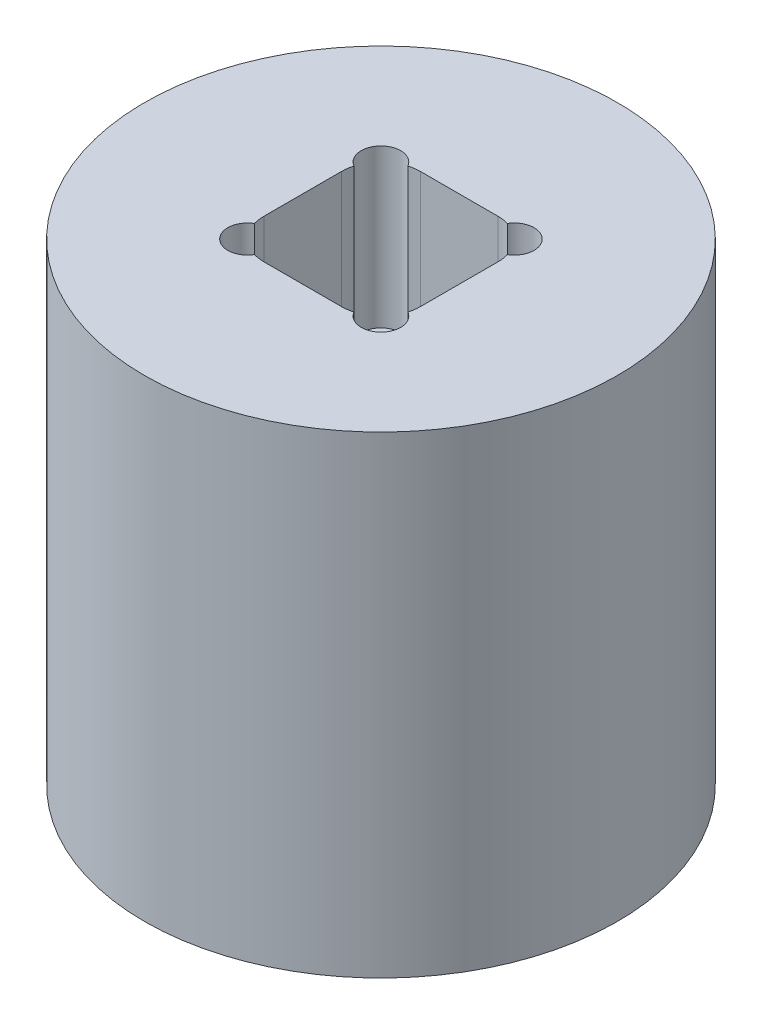
ISO-10303-21;
HEADER;
FILE_DESCRIPTION(('STEP AP214'),'2;1');
FILE_NAME('part.step','',(''),(''),'','','');
FILE_SCHEMA(('AUTOMOTIVE_DESIGN { 1 0 10303 214 1 1 1 1 }'));
ENDSEC;
DATA;
#1=APPLICATION_CONTEXT('core data for automotive mechanical design processes');
#2=APPLICATION_PROTOCOL_DEFINITION('international standard','automotive_design',2000,#1);
#3=PRODUCT_CONTEXT('',#1,'mechanical');
#4=PRODUCT('Part','Part','',(#3));
#5=PRODUCT_RELATED_PRODUCT_CATEGORY('part','',(#4));
#6=PRODUCT_DEFINITION_FORMATION('','',#4);
#7=PRODUCT_DEFINITION_CONTEXT('part definition',#1,'design');
#8=PRODUCT_DEFINITION('design','',#6,#7);
#9=PRODUCT_DEFINITION_SHAPE('','',#8);
#10=(LENGTH_UNIT() NAMED_UNIT(*) SI_UNIT(.MILLI.,.METRE.));
#11=(NAMED_UNIT(*) PLANE_ANGLE_UNIT() SI_UNIT($,.RADIAN.));
#12=(NAMED_UNIT(*) SI_UNIT($,.STERADIAN.) SOLID_ANGLE_UNIT());
#13=UNCERTAINTY_MEASURE_WITH_UNIT(LENGTH_MEASURE(1.E-05),#10,'distance_accuracy_value','');
#14=(GEOMETRIC_REPRESENTATION_CONTEXT(3) GLOBAL_UNCERTAINTY_ASSIGNED_CONTEXT((#13)) GLOBAL_UNIT_ASSIGNED_CONTEXT((#10,
#11,#12)) REPRESENTATION_CONTEXT('',''));
#15=CARTESIAN_POINT('',(0.,0.,0.));
#16=DIRECTION('',(0.,0.,1.));
#17=DIRECTION('',(1.,0.,0.));
#18=AXIS2_PLACEMENT_3D('',#15,#16,#17);
#19=CARTESIAN_POINT('',(3.13055,6.35,3.13055));
#20=DIRECTION('',(0.,1.,0.));
#21=DIRECTION('',(0.,0.,1.));
#22=AXIS2_PLACEMENT_3D('',#19,#20,#21);
#23=CYLINDRICAL_SURFACE('',#22,3.175);
#24=CARTESIAN_POINT('',(3.13055,6.35,3.13055));
#25=DIRECTION('',(0.,1.,0.));
#26=DIRECTION('',(0.,0.,1.));
#27=AXIS2_PLACEMENT_3D('',#24,#25,#26);
#28=CIRCLE('',#27,3.175);
#29=CARTESIAN_POINT('',(6.18186797653319,6.35,4.00809407643456));
#30=VERTEX_POINT('',#29);
#31=CARTESIAN_POINT('',(6.30555,6.35,3.13055));
#32=VERTEX_POINT('',#31);
#33=EDGE_CURVE('E255',#30,#32,#28,.T.);
#34=ORIENTED_EDGE('',*,*,#33,.F.);
#35=DIRECTION('',(0.,1.,0.));
#36=VECTOR('',#35,1.);
#37=CARTESIAN_POINT('',(6.18186797653319,12.7,4.00809407643456));
#38=LINE('',#37,#36);
#39=CARTESIAN_POINT('',(6.18186797653319,19.05,4.00809407643456));
#40=VERTEX_POINT('',#39);
#41=EDGE_CURVE('E11',#30,#40,#38,.T.);
#42=ORIENTED_EDGE('',*,*,#41,.T.);
#43=CARTESIAN_POINT('',(3.13055,19.05,3.13055));
#44=DIRECTION('',(0.,1.,0.));
#45=DIRECTION('',(0.,0.,1.));
#46=AXIS2_PLACEMENT_3D('',#43,#44,#45);
#47=CIRCLE('',#46,3.175);
#48=CARTESIAN_POINT('',(6.30555,19.05,3.13055));
#49=VERTEX_POINT('',#48);
#50=EDGE_CURVE('E270',#49,#40,#47,.F.);
#51=ORIENTED_EDGE('',*,*,#50,.F.);
#52=DIRECTION('',(0.,1.,0.));
#53=VECTOR('',#52,1.);
#54=CARTESIAN_POINT('',(6.30555,6.35,3.13055));
#55=LINE('',#54,#53);
#56=EDGE_CURVE('E310',#32,#49,#55,.T.);
#57=ORIENTED_EDGE('',*,*,#56,.F.);
#58=EDGE_LOOP('',(#34,#42,#51,#57));
#59=FACE_BOUND('',#58,.T.);
#60=ADVANCED_FACE('F35',(#59),#23,.F.);
#61=CARTESIAN_POINT('',(-3.13055,6.35,3.13055));
#62=DIRECTION('',(0.,-1.,0.));
#63=DIRECTION('',(0.,0.,-1.));
#64=AXIS2_PLACEMENT_3D('',#61,#62,#63);
#65=CYLINDRICAL_SURFACE('',#64,3.175);
#66=CARTESIAN_POINT('',(-3.13055,19.05,3.13055));
#67=DIRECTION('',(0.,1.,0.));
#68=DIRECTION('',(0.,0.,1.));
#69=AXIS2_PLACEMENT_3D('',#66,#67,#68);
#70=CIRCLE('',#69,3.175);
#71=CARTESIAN_POINT('',(-6.18186797653319,19.05,4.00809407643456));
#72=VERTEX_POINT('',#71);
#73=CARTESIAN_POINT('',(-6.30555,19.05,3.13055));
#74=VERTEX_POINT('',#73);
#75=EDGE_CURVE('E272',#72,#74,#70,.F.);
#76=ORIENTED_EDGE('',*,*,#75,.F.);
#77=DIRECTION('',(0.,1.,0.));
#78=VECTOR('',#77,1.);
#79=CARTESIAN_POINT('',(-6.18186797653319,12.7,4.00809407643456));
#80=LINE('',#79,#78);
#81=CARTESIAN_POINT('',(-6.18186797653319,6.35,4.00809407643456));
#82=VERTEX_POINT('',#81);
#83=EDGE_CURVE('E239',#72,#82,#80,.F.);
#84=ORIENTED_EDGE('',*,*,#83,.T.);
#85=CARTESIAN_POINT('',(-3.13055,6.35,3.13055));
#86=DIRECTION('',(0.,1.,0.));
#87=DIRECTION('',(0.,0.,1.));
#88=AXIS2_PLACEMENT_3D('',#85,#86,#87);
#89=CIRCLE('',#88,3.175);
#90=CARTESIAN_POINT('',(-6.30555,6.35,3.13055));
#91=VERTEX_POINT('',#90);
#92=EDGE_CURVE('E260',#91,#82,#89,.T.);
#93=ORIENTED_EDGE('',*,*,#92,.F.);
#94=DIRECTION('',(0.,1.,0.));
#95=VECTOR('',#94,1.);
#96=CARTESIAN_POINT('',(-6.30555,6.35,3.13055));
#97=LINE('',#96,#95);
#98=EDGE_CURVE('E258',#74,#91,#97,.F.);
#99=ORIENTED_EDGE('',*,*,#98,.F.);
#100=EDGE_LOOP('',(#76,#84,#93,#99));
#101=FACE_BOUND('',#100,.T.);
#102=ADVANCED_FACE('F293',(#101),#65,.F.);
#103=CARTESIAN_POINT('',(-3.13055,6.35,-3.13055));
#104=DIRECTION('',(0.,1.,0.));
#105=DIRECTION('',(0.,0.,1.));
#106=AXIS2_PLACEMENT_3D('',#103,#104,#105);
#107=CYLINDRICAL_SURFACE('',#106,3.175);
#108=CARTESIAN_POINT('',(-3.13055,6.35,-3.13055));
#109=DIRECTION('',(0.,1.,0.));
#110=DIRECTION('',(0.,0.,1.));
#111=AXIS2_PLACEMENT_3D('',#108,#109,#110);
#112=CIRCLE('',#111,3.175);
#113=CARTESIAN_POINT('',(-6.18186797653319,6.35,-4.00809407643456));
#114=VERTEX_POINT('',#113);
#115=CARTESIAN_POINT('',(-6.30555,6.35,-3.13055));
#116=VERTEX_POINT('',#115);
#117=EDGE_CURVE('E298',#114,#116,#112,.T.);
#118=ORIENTED_EDGE('',*,*,#117,.F.);
#119=DIRECTION('',(0.,1.,0.));
#120=VECTOR('',#119,1.);
#121=CARTESIAN_POINT('',(-6.18186797653319,12.7,-4.00809407643456));
#122=LINE('',#121,#120);
#123=CARTESIAN_POINT('',(-6.18186797653319,19.05,-4.00809407643456));
#124=VERTEX_POINT('',#123);
#125=EDGE_CURVE('E233',#114,#124,#122,.T.);
#126=ORIENTED_EDGE('',*,*,#125,.T.);
#127=CARTESIAN_POINT('',(-3.13055,19.05,-3.13055));
#128=DIRECTION('',(0.,1.,0.));
#129=DIRECTION('',(0.,0.,1.));
#130=AXIS2_PLACEMENT_3D('',#127,#128,#129);
#131=CIRCLE('',#130,3.175);
#132=CARTESIAN_POINT('',(-6.30555,19.05,-3.13055));
#133=VERTEX_POINT('',#132);
#134=EDGE_CURVE('E223',#133,#124,#131,.F.);
#135=ORIENTED_EDGE('',*,*,#134,.F.);
#136=DIRECTION('',(0.,1.,0.));
#137=VECTOR('',#136,1.);
#138=CARTESIAN_POINT('',(-6.30555,6.35,-3.13055));
#139=LINE('',#138,#137);
#140=EDGE_CURVE('E254',#116,#133,#139,.T.);
#141=ORIENTED_EDGE('',*,*,#140,.F.);
#142=EDGE_LOOP('',(#118,#126,#135,#141));
#143=FACE_BOUND('',#142,.T.);
#144=ADVANCED_FACE('F411',(#143),#107,.F.);
#145=CARTESIAN_POINT('',(3.13055,6.35,-3.13055));
#146=DIRECTION('',(0.,-1.,0.));
#147=DIRECTION('',(0.,0.,-1.));
#148=AXIS2_PLACEMENT_3D('',#145,#146,#147);
#149=CYLINDRICAL_SURFACE('',#148,3.175);
#150=CARTESIAN_POINT('',(3.13055,19.05,-3.13055));
#151=DIRECTION('',(0.,1.,0.));
#152=DIRECTION('',(0.,0.,1.));
#153=AXIS2_PLACEMENT_3D('',#150,#151,#152);
#154=CIRCLE('',#153,3.175);
#155=CARTESIAN_POINT('',(6.18186797653319,19.05,-4.00809407643456));
#156=VERTEX_POINT('',#155);
#157=CARTESIAN_POINT('',(6.30555,19.05,-3.13055));
#158=VERTEX_POINT('',#157);
#159=EDGE_CURVE('E214',#156,#158,#154,.F.);
#160=ORIENTED_EDGE('',*,*,#159,.F.);
#161=DIRECTION('',(0.,1.,0.));
#162=VECTOR('',#161,1.);
#163=CARTESIAN_POINT('',(6.18186797653319,12.7,-4.00809407643456));
#164=LINE('',#163,#162);
#165=CARTESIAN_POINT('',(6.18186797653319,6.35,-4.00809407643456));
#166=VERTEX_POINT('',#165);
#167=EDGE_CURVE('E194',#156,#166,#164,.F.);
#168=ORIENTED_EDGE('',*,*,#167,.T.);
#169=CARTESIAN_POINT('',(3.13055,6.35,-3.13055));
#170=DIRECTION('',(0.,1.,0.));
#171=DIRECTION('',(0.,0.,1.));
#172=AXIS2_PLACEMENT_3D('',#169,#170,#171);
#173=CIRCLE('',#172,3.175);
#174=CARTESIAN_POINT('',(6.30555,6.35,-3.13055));
#175=VERTEX_POINT('',#174);
#176=EDGE_CURVE('E301',#175,#166,#173,.T.);
#177=ORIENTED_EDGE('',*,*,#176,.F.);
#178=DIRECTION('',(0.,1.,0.));
#179=VECTOR('',#178,1.);
#180=CARTESIAN_POINT('',(6.30555,6.35,-3.13055));
#181=LINE('',#180,#179);
#182=EDGE_CURVE('E222',#158,#175,#181,.F.);
#183=ORIENTED_EDGE('',*,*,#182,.F.);
#184=EDGE_LOOP('',(#160,#168,#177,#183));
#185=FACE_BOUND('',#184,.T.);
#186=ADVANCED_FACE('F221',(#185),#149,.F.);
#187=CARTESIAN_POINT('',(0.,19.05,0.));
#188=DIRECTION('',(0.,1.,0.));
#189=DIRECTION('',(0.,0.,1.));
#190=AXIS2_PLACEMENT_3D('',#187,#188,#189);
#191=PLANE('',#190);
#192=CARTESIAN_POINT('',(5.37561403026729,19.05,5.37561403026729));
#193=DIRECTION('',(0.,1.,0.));
#194=DIRECTION('',(0.,0.,1.));
#195=AXIS2_PLACEMENT_3D('',#192,#193,#194);
#196=CIRCLE('',#195,1.5875);
#197=CARTESIAN_POINT('',(4.00809407643456,19.05,6.18186797653319));
#198=VERTEX_POINT('',#197);
#199=EDGE_CURVE('E398',#198,#40,#196,.T.);
#200=ORIENTED_EDGE('',*,*,#199,.F.);
#201=CARTESIAN_POINT('',(3.13055,19.05,6.30555));
#202=VERTEX_POINT('',#201);
#203=EDGE_CURVE('E248',#198,#202,#47,.F.);
#204=ORIENTED_EDGE('',*,*,#203,.T.);
#205=DIRECTION('',(-1.,0.,0.));
#206=VECTOR('',#205,1.);
#207=CARTESIAN_POINT('',(0.,19.05,6.30555));
#208=LINE('',#207,#206);
#209=CARTESIAN_POINT('',(-3.13055,19.05,6.30555));
#210=VERTEX_POINT('',#209);
#211=EDGE_CURVE('E289',#202,#210,#208,.T.);
#212=ORIENTED_EDGE('',*,*,#211,.T.);
#213=CARTESIAN_POINT('',(-4.00809407643456,19.05,6.18186797653319));
#214=VERTEX_POINT('',#213);
#215=EDGE_CURVE('E273',#210,#214,#70,.F.);
#216=ORIENTED_EDGE('',*,*,#215,.T.);
#217=CARTESIAN_POINT('',(-5.37561403026729,19.05,5.37561403026729));
#218=DIRECTION('',(0.,1.,0.));
#219=DIRECTION('',(0.,0.,1.));
#220=AXIS2_PLACEMENT_3D('',#217,#218,#219);
#221=CIRCLE('',#220,1.5875);
#222=EDGE_CURVE('E281',#72,#214,#221,.T.);
#223=ORIENTED_EDGE('',*,*,#222,.F.);
#224=ORIENTED_EDGE('',*,*,#75,.T.);
#225=DIRECTION('',(0.,0.,-1.));
#226=VECTOR('',#225,1.);
#227=CARTESIAN_POINT('',(-6.30555,19.05,0.));
#228=LINE('',#227,#226);
#229=EDGE_CURVE('E280',#74,#133,#228,.T.);
#230=ORIENTED_EDGE('',*,*,#229,.T.);
#231=ORIENTED_EDGE('',*,*,#134,.T.);
#232=CARTESIAN_POINT('',(-5.37561403026729,19.05,-5.37561403026729));
#233=DIRECTION('',(0.,1.,0.));
#234=DIRECTION('',(0.,0.,1.));
#235=AXIS2_PLACEMENT_3D('',#232,#233,#234);
#236=CIRCLE('',#235,1.5875);
#237=CARTESIAN_POINT('',(-4.00809407643456,19.05,-6.18186797653319));
#238=VERTEX_POINT('',#237);
#239=EDGE_CURVE('E403',#238,#124,#236,.T.);
#240=ORIENTED_EDGE('',*,*,#239,.F.);
#241=CARTESIAN_POINT('',(-3.13055,19.05,-6.30555));
#242=VERTEX_POINT('',#241);
#243=EDGE_CURVE('E226',#238,#242,#131,.F.);
#244=ORIENTED_EDGE('',*,*,#243,.T.);
#245=DIRECTION('',(-1.,0.,0.));
#246=VECTOR('',#245,1.);
#247=CARTESIAN_POINT('',(0.,19.05,-6.30555));
#248=LINE('',#247,#246);
#249=CARTESIAN_POINT('',(3.13055,19.05,-6.30555));
#250=VERTEX_POINT('',#249);
#251=EDGE_CURVE('E321',#250,#242,#248,.T.);
#252=ORIENTED_EDGE('',*,*,#251,.F.);
#253=CARTESIAN_POINT('',(4.00809407643456,19.05,-6.18186797653319));
#254=VERTEX_POINT('',#253);
#255=EDGE_CURVE('E217',#250,#254,#154,.F.);
#256=ORIENTED_EDGE('',*,*,#255,.T.);
#257=CARTESIAN_POINT('',(5.37561403026729,19.05,-5.37561403026729));
#258=DIRECTION('',(0.,1.,0.));
#259=DIRECTION('',(0.,0.,1.));
#260=AXIS2_PLACEMENT_3D('',#257,#258,#259);
#261=CIRCLE('',#260,1.5875);
#262=EDGE_CURVE('E198',#156,#254,#261,.T.);
#263=ORIENTED_EDGE('',*,*,#262,.F.);
#264=ORIENTED_EDGE('',*,*,#159,.T.);
#265=DIRECTION('',(0.,0.,-1.));
#266=VECTOR('',#265,1.);
#267=CARTESIAN_POINT('',(6.30555,19.05,0.));
#268=LINE('',#267,#266);
#269=EDGE_CURVE('E325',#49,#158,#268,.T.);
#270=ORIENTED_EDGE('',*,*,#269,.F.);
#271=ORIENTED_EDGE('',*,*,#50,.T.);
#272=EDGE_LOOP('',(#200,#204,#212,#216,#223,#224,#230,#231,#240,#244,#252,#256,#263,#264,#270,#271));
#273=FACE_BOUND('',#272,.T.);
#274=CARTESIAN_POINT('',(0.,19.05,0.));
#275=DIRECTION('',(0.,1.,0.));
#276=DIRECTION('',(0.,0.,1.));
#277=AXIS2_PLACEMENT_3D('',#274,#275,#276);
#278=CIRCLE('',#277,19.05);
#279=CARTESIAN_POINT('',(0.,19.05,19.05));
#280=VERTEX_POINT('',#279);
#281=EDGE_CURVE('E314',#280,#280,#278,.T.);
#282=ORIENTED_EDGE('',*,*,#281,.T.);
#283=EDGE_LOOP('',(#282));
#284=FACE_BOUND('',#283,.T.);
#285=ADVANCED_FACE('F211',(#273,#284),#191,.T.);
#286=CARTESIAN_POINT('',(0.,19.05,0.));
#287=DIRECTION('',(0.,-1.,0.));
#288=DIRECTION('',(0.,0.,-1.));
#289=AXIS2_PLACEMENT_3D('',#286,#287,#288);
#290=CYLINDRICAL_SURFACE('',#289,19.05);
#291=ORIENTED_EDGE('',*,*,#281,.F.);
#292=EDGE_LOOP('',(#291));
#293=FACE_BOUND('',#292,.T.);
#294=CARTESIAN_POINT('',(0.,-19.05,0.));
#295=DIRECTION('',(0.,1.,0.));
#296=DIRECTION('',(0.,0.,1.));
#297=AXIS2_PLACEMENT_3D('',#294,#295,#296);
#298=CIRCLE('',#297,19.05);
#299=CARTESIAN_POINT('',(0.,-19.05,19.05));
#300=VERTEX_POINT('',#299);
#301=EDGE_CURVE('E315',#300,#300,#298,.T.);
#302=ORIENTED_EDGE('',*,*,#301,.T.);
#303=EDGE_LOOP('',(#302));
#304=FACE_BOUND('',#303,.T.);
#305=ADVANCED_FACE('F501',(#293,#304),#290,.T.);
#306=CARTESIAN_POINT('',(0.,-19.05,0.));
#307=DIRECTION('',(0.,1.,0.));
#308=DIRECTION('',(0.,0.,1.));
#309=AXIS2_PLACEMENT_3D('',#306,#307,#308);
#310=PLANE('',#309);
#311=DIRECTION('',(-1.,0.,0.));
#312=VECTOR('',#311,1.);
#313=CARTESIAN_POINT('',(9.12494999999999,-19.05,12.29995));
#314=LINE('',#313,#312);
#315=CARTESIAN_POINT('',(9.12494999999999,-19.05,12.29995));
#316=VERTEX_POINT('',#315);
#317=CARTESIAN_POINT('',(-9.12495000000001,-19.05,12.29995));
#318=VERTEX_POINT('',#317);
#319=EDGE_CURVE('E370',#316,#318,#314,.T.);
#320=ORIENTED_EDGE('',*,*,#319,.F.);
#321=CARTESIAN_POINT('',(9.12494999999999,-19.05,9.12495));
#322=DIRECTION('',(0.,-1.,0.));
#323=DIRECTION('',(0.,0.,1.));
#324=AXIS2_PLACEMENT_3D('',#321,#322,#323);
#325=CIRCLE('',#324,3.175);
#326=CARTESIAN_POINT('',(12.29995,-19.05,9.12495));
#327=VERTEX_POINT('',#326);
#328=EDGE_CURVE('E373',#327,#316,#325,.T.);
#329=ORIENTED_EDGE('',*,*,#328,.F.);
#330=DIRECTION('',(0.,0.,1.));
#331=VECTOR('',#330,1.);
#332=CARTESIAN_POINT('',(12.29995,-19.05,9.12495));
#333=LINE('',#332,#331);
#334=CARTESIAN_POINT('',(12.29995,-19.05,-9.12494999999998));
#335=VERTEX_POINT('',#334);
#336=EDGE_CURVE('E351',#335,#327,#333,.T.);
#337=ORIENTED_EDGE('',*,*,#336,.F.);
#338=CARTESIAN_POINT('',(9.12495,-19.05,-9.12495));
#339=DIRECTION('',(0.,-1.,0.));
#340=DIRECTION('',(0.,0.,1.));
#341=AXIS2_PLACEMENT_3D('',#338,#339,#340);
#342=CIRCLE('',#341,3.175);
#343=CARTESIAN_POINT('',(9.12494999999998,-19.05,-12.29995));
#344=VERTEX_POINT('',#343);
#345=EDGE_CURVE('E355',#344,#335,#342,.T.);
#346=ORIENTED_EDGE('',*,*,#345,.F.);
#347=DIRECTION('',(1.,0.,0.));
#348=VECTOR('',#347,1.);
#349=CARTESIAN_POINT('',(9.12494999999998,-19.05,-12.29995));
#350=LINE('',#349,#348);
#351=CARTESIAN_POINT('',(-9.12495000000001,-19.05,-12.29995));
#352=VERTEX_POINT('',#351);
#353=EDGE_CURVE('E358',#352,#344,#350,.T.);
#354=ORIENTED_EDGE('',*,*,#353,.F.);
#355=CARTESIAN_POINT('',(-9.12495000000001,-19.05,-9.12495000000001));
#356=DIRECTION('',(0.,-1.,0.));
#357=DIRECTION('',(0.,0.,1.));
#358=AXIS2_PLACEMENT_3D('',#355,#356,#357);
#359=CIRCLE('',#358,3.175);
#360=CARTESIAN_POINT('',(-12.29995,-19.05,-9.12495000000001));
#361=VERTEX_POINT('',#360);
#362=EDGE_CURVE('E361',#361,#352,#359,.T.);
#363=ORIENTED_EDGE('',*,*,#362,.F.);
#364=DIRECTION('',(0.,0.,-1.));
#365=VECTOR('',#364,1.);
#366=CARTESIAN_POINT('',(-12.29995,-19.05,9.12495));
#367=LINE('',#366,#365);
#368=CARTESIAN_POINT('',(-12.29995,-19.05,9.12495));
#369=VERTEX_POINT('',#368);
#370=EDGE_CURVE('E364',#369,#361,#367,.T.);
#371=ORIENTED_EDGE('',*,*,#370,.F.);
#372=CARTESIAN_POINT('',(-9.12495000000001,-19.05,9.12495));
#373=DIRECTION('',(0.,-1.,0.));
#374=DIRECTION('',(0.,0.,-1.));
#375=AXIS2_PLACEMENT_3D('',#372,#373,#374);
#376=CIRCLE('',#375,3.175);
#377=EDGE_CURVE('E367',#318,#369,#376,.T.);
#378=ORIENTED_EDGE('',*,*,#377,.F.);
#379=EDGE_LOOP('',(#320,#329,#337,#346,#354,#363,#371,#378));
#380=FACE_BOUND('',#379,.T.);
#381=ORIENTED_EDGE('',*,*,#301,.F.);
#382=EDGE_LOOP('',(#381));
#383=FACE_BOUND('',#382,.T.);
#384=ADVANCED_FACE('F498',(#380,#383),#310,.F.);
#385=CARTESIAN_POINT('',(-6.30555,6.35,0.));
#386=DIRECTION('',(1.,0.,0.));
#387=DIRECTION('',(0.,0.,-1.));
#388=AXIS2_PLACEMENT_3D('',#385,#386,#387);
#389=PLANE('',#388);
#390=ORIENTED_EDGE('',*,*,#229,.F.);
#391=ORIENTED_EDGE('',*,*,#98,.T.);
#392=DIRECTION('',(0.,0.,-1.));
#393=VECTOR('',#392,1.);
#394=CARTESIAN_POINT('',(-6.30555,6.35,0.));
#395=LINE('',#394,#393);
#396=EDGE_CURVE('E324',#91,#116,#395,.T.);
#397=ORIENTED_EDGE('',*,*,#396,.T.);
#398=ORIENTED_EDGE('',*,*,#140,.T.);
#399=EDGE_LOOP('',(#390,#391,#397,#398));
#400=FACE_BOUND('',#399,.T.);
#401=ADVANCED_FACE('F285',(#400),#389,.T.);
#402=CARTESIAN_POINT('',(0.,6.35,-6.30555));
#403=DIRECTION('',(0.,0.,-1.));
#404=DIRECTION('',(-1.,0.,0.));
#405=AXIS2_PLACEMENT_3D('',#402,#403,#404);
#406=PLANE('',#405);
#407=ORIENTED_EDGE('',*,*,#251,.T.);
#408=DIRECTION('',(0.,1.,0.));
#409=VECTOR('',#408,1.);
#410=CARTESIAN_POINT('',(-3.13055,6.35,-6.30555));
#411=LINE('',#410,#409);
#412=CARTESIAN_POINT('',(-3.13055,6.35,-6.30555));
#413=VERTEX_POINT('',#412);
#414=EDGE_CURVE('E268',#242,#413,#411,.F.);
#415=ORIENTED_EDGE('',*,*,#414,.T.);
#416=DIRECTION('',(-1.,0.,0.));
#417=VECTOR('',#416,1.);
#418=CARTESIAN_POINT('',(0.,6.35,-6.30555));
#419=LINE('',#418,#417);
#420=CARTESIAN_POINT('',(3.13055,6.35,-6.30555));
#421=VERTEX_POINT('',#420);
#422=EDGE_CURVE('E318',#421,#413,#419,.T.);
#423=ORIENTED_EDGE('',*,*,#422,.F.);
#424=DIRECTION('',(0.,1.,0.));
#425=VECTOR('',#424,1.);
#426=CARTESIAN_POINT('',(3.13055,19.05,-6.30555));
#427=LINE('',#426,#425);
#428=EDGE_CURVE('E265',#421,#250,#427,.T.);
#429=ORIENTED_EDGE('',*,*,#428,.T.);
#430=EDGE_LOOP('',(#407,#415,#423,#429));
#431=FACE_BOUND('',#430,.T.);
#432=ADVANCED_FACE('F418',(#431),#406,.F.);
#433=CARTESIAN_POINT('',(6.30555,6.35,0.));
#434=DIRECTION('',(1.,0.,0.));
#435=DIRECTION('',(0.,0.,-1.));
#436=AXIS2_PLACEMENT_3D('',#433,#434,#435);
#437=PLANE('',#436);
#438=DIRECTION('',(0.,0.,-1.));
#439=VECTOR('',#438,1.);
#440=CARTESIAN_POINT('',(6.30555,6.35,0.));
#441=LINE('',#440,#439);
#442=EDGE_CURVE('E329',#32,#175,#441,.T.);
#443=ORIENTED_EDGE('',*,*,#442,.F.);
#444=ORIENTED_EDGE('',*,*,#56,.T.);
#445=ORIENTED_EDGE('',*,*,#269,.T.);
#446=ORIENTED_EDGE('',*,*,#182,.T.);
#447=EDGE_LOOP('',(#443,#444,#445,#446));
#448=FACE_BOUND('',#447,.T.);
#449=ADVANCED_FACE('F489',(#448),#437,.F.);
#450=CARTESIAN_POINT('',(0.,6.35,6.30555));
#451=DIRECTION('',(0.,0.,-1.));
#452=DIRECTION('',(-1.,0.,0.));
#453=AXIS2_PLACEMENT_3D('',#450,#451,#452);
#454=PLANE('',#453);
#455=ORIENTED_EDGE('',*,*,#211,.F.);
#456=DIRECTION('',(0.,1.,0.));
#457=VECTOR('',#456,1.);
#458=CARTESIAN_POINT('',(3.13055,6.35,6.30555));
#459=LINE('',#458,#457);
#460=CARTESIAN_POINT('',(3.13055,6.35,6.30555));
#461=VERTEX_POINT('',#460);
#462=EDGE_CURVE('E305',#202,#461,#459,.F.);
#463=ORIENTED_EDGE('',*,*,#462,.T.);
#464=DIRECTION('',(-1.,0.,0.));
#465=VECTOR('',#464,1.);
#466=CARTESIAN_POINT('',(0.,6.35,6.30555));
#467=LINE('',#466,#465);
#468=CARTESIAN_POINT('',(-3.13055,6.35,6.30555));
#469=VERTEX_POINT('',#468);
#470=EDGE_CURVE('E253',#461,#469,#467,.T.);
#471=ORIENTED_EDGE('',*,*,#470,.T.);
#472=DIRECTION('',(0.,1.,0.));
#473=VECTOR('',#472,1.);
#474=CARTESIAN_POINT('',(-3.13055,19.05,6.30555));
#475=LINE('',#474,#473);
#476=EDGE_CURVE('E307',#469,#210,#475,.T.);
#477=ORIENTED_EDGE('',*,*,#476,.T.);
#478=EDGE_LOOP('',(#455,#463,#471,#477));
#479=FACE_BOUND('',#478,.T.);
#480=ADVANCED_FACE('F486',(#479),#454,.T.);
#481=CARTESIAN_POINT('',(0.,6.35,0.));
#482=DIRECTION('',(0.,1.,0.));
#483=DIRECTION('',(0.,0.,1.));
#484=AXIS2_PLACEMENT_3D('',#481,#482,#483);
#485=PLANE('',#484);
#486=CARTESIAN_POINT('',(4.00809407643456,6.35,6.18186797653319));
#487=VERTEX_POINT('',#486);
#488=EDGE_CURVE('E247',#461,#487,#28,.T.);
#489=ORIENTED_EDGE('',*,*,#488,.T.);
#490=CARTESIAN_POINT('',(5.37561403026729,6.35,5.37561403026729));
#491=DIRECTION('',(0.,1.,0.));
#492=DIRECTION('',(0.,0.,1.));
#493=AXIS2_PLACEMENT_3D('',#490,#491,#492);
#494=CIRCLE('',#493,1.5875);
#495=EDGE_CURVE('E50',#487,#30,#494,.T.);
#496=ORIENTED_EDGE('',*,*,#495,.T.);
#497=ORIENTED_EDGE('',*,*,#33,.T.);
#498=ORIENTED_EDGE('',*,*,#442,.T.);
#499=ORIENTED_EDGE('',*,*,#176,.T.);
#500=CARTESIAN_POINT('',(5.37561403026729,6.35,-5.37561403026729));
#501=DIRECTION('',(0.,1.,0.));
#502=DIRECTION('',(0.,0.,1.));
#503=AXIS2_PLACEMENT_3D('',#500,#501,#502);
#504=CIRCLE('',#503,1.5875);
#505=CARTESIAN_POINT('',(4.00809407643456,6.35,-6.18186797653319));
#506=VERTEX_POINT('',#505);
#507=EDGE_CURVE('E200',#166,#506,#504,.T.);
#508=ORIENTED_EDGE('',*,*,#507,.T.);
#509=EDGE_CURVE('E304',#506,#421,#173,.T.);
#510=ORIENTED_EDGE('',*,*,#509,.T.);
#511=ORIENTED_EDGE('',*,*,#422,.T.);
#512=CARTESIAN_POINT('',(-4.00809407643456,6.35,-6.18186797653319));
#513=VERTEX_POINT('',#512);
#514=EDGE_CURVE('E295',#413,#513,#112,.T.);
#515=ORIENTED_EDGE('',*,*,#514,.T.);
#516=CARTESIAN_POINT('',(-5.37561403026729,6.35,-5.37561403026729));
#517=DIRECTION('',(0.,1.,0.));
#518=DIRECTION('',(0.,0.,1.));
#519=AXIS2_PLACEMENT_3D('',#516,#517,#518);
#520=CIRCLE('',#519,1.5875);
#521=EDGE_CURVE('E218',#513,#114,#520,.T.);
#522=ORIENTED_EDGE('',*,*,#521,.T.);
#523=ORIENTED_EDGE('',*,*,#117,.T.);
#524=ORIENTED_EDGE('',*,*,#396,.F.);
#525=ORIENTED_EDGE('',*,*,#92,.T.);
#526=CARTESIAN_POINT('',(-5.37561403026729,6.35,5.37561403026729));
#527=DIRECTION('',(0.,1.,0.));
#528=DIRECTION('',(0.,0.,1.));
#529=AXIS2_PLACEMENT_3D('',#526,#527,#528);
#530=CIRCLE('',#529,1.5875);
#531=CARTESIAN_POINT('',(-4.00809407643456,6.35,6.18186797653319));
#532=VERTEX_POINT('',#531);
#533=EDGE_CURVE('E57',#82,#532,#530,.T.);
#534=ORIENTED_EDGE('',*,*,#533,.T.);
#535=EDGE_CURVE('E294',#532,#469,#89,.T.);
#536=ORIENTED_EDGE('',*,*,#535,.T.);
#537=ORIENTED_EDGE('',*,*,#470,.F.);
#538=EDGE_LOOP('',(#489,#496,#497,#498,#499,#508,#510,#511,#515,#522,#523,#524,#525,#534,#536,#537));
#539=FACE_BOUND('',#538,.T.);
#540=ADVANCED_FACE('F251',(#539),#485,.T.);
#541=CARTESIAN_POINT('',(9.12494999999999,0.,9.12495));
#542=DIRECTION('',(0.,-1.,0.));
#543=DIRECTION('',(0.,0.,-1.));
#544=AXIS2_PLACEMENT_3D('',#541,#542,#543);
#545=CYLINDRICAL_SURFACE('',#544,3.175);
#546=ORIENTED_EDGE('',*,*,#328,.T.);
#547=DIRECTION('',(0.,-1.,0.));
#548=VECTOR('',#547,1.);
#549=CARTESIAN_POINT('',(9.12494999999999,0.,12.29995));
#550=LINE('',#549,#548);
#551=CARTESIAN_POINT('',(9.12494999999999,0.,12.29995));
#552=VERTEX_POINT('',#551);
#553=EDGE_CURVE('E334',#552,#316,#550,.T.);
#554=ORIENTED_EDGE('',*,*,#553,.F.);
#555=CARTESIAN_POINT('',(9.12494999999999,0.,9.12495));
#556=DIRECTION('',(0.,-1.,0.));
#557=DIRECTION('',(0.,0.,1.));
#558=AXIS2_PLACEMENT_3D('',#555,#556,#557);
#559=CIRCLE('',#558,3.175);
#560=CARTESIAN_POINT('',(12.29995,0.,9.12495));
#561=VERTEX_POINT('',#560);
#562=EDGE_CURVE('E354',#561,#552,#559,.T.);
#563=ORIENTED_EDGE('',*,*,#562,.F.);
#564=DIRECTION('',(0.,-1.,0.));
#565=VECTOR('',#564,1.);
#566=CARTESIAN_POINT('',(12.29995,0.,9.12495));
#567=LINE('',#566,#565);
#568=EDGE_CURVE('E290',#561,#327,#567,.T.);
#569=ORIENTED_EDGE('',*,*,#568,.T.);
#570=EDGE_LOOP('',(#546,#554,#563,#569));
#571=FACE_BOUND('',#570,.T.);
#572=ADVANCED_FACE('F461',(#571),#545,.F.);
#573=CARTESIAN_POINT('',(12.29995,0.,9.12495));
#574=DIRECTION('',(1.,0.,0.));
#575=DIRECTION('',(0.,0.,-1.));
#576=AXIS2_PLACEMENT_3D('',#573,#574,#575);
#577=PLANE('',#576);
#578=ORIENTED_EDGE('',*,*,#336,.T.);
#579=ORIENTED_EDGE('',*,*,#568,.F.);
#580=DIRECTION('',(0.,0.,1.));
#581=VECTOR('',#580,1.);
#582=CARTESIAN_POINT('',(12.29995,0.,9.12495));
#583=LINE('',#582,#581);
#584=CARTESIAN_POINT('',(12.29995,0.,-9.12494999999998));
#585=VERTEX_POINT('',#584);
#586=EDGE_CURVE('E338',#585,#561,#583,.T.);
#587=ORIENTED_EDGE('',*,*,#586,.F.);
#588=DIRECTION('',(0.,-1.,0.));
#589=VECTOR('',#588,1.);
#590=CARTESIAN_POINT('',(12.29995,0.,-9.12494999999998));
#591=LINE('',#590,#589);
#592=EDGE_CURVE('E348',#585,#335,#591,.T.);
#593=ORIENTED_EDGE('',*,*,#592,.T.);
#594=EDGE_LOOP('',(#578,#579,#587,#593));
#595=FACE_BOUND('',#594,.T.);
#596=ADVANCED_FACE('F457',(#595),#577,.F.);
#597=CARTESIAN_POINT('',(9.12495,0.,-9.12495));
#598=DIRECTION('',(0.,-1.,0.));
#599=DIRECTION('',(0.,0.,-1.));
#600=AXIS2_PLACEMENT_3D('',#597,#598,#599);
#601=CYLINDRICAL_SURFACE('',#600,3.175);
#602=ORIENTED_EDGE('',*,*,#345,.T.);
#603=ORIENTED_EDGE('',*,*,#592,.F.);
#604=CARTESIAN_POINT('',(9.12495,0.,-9.12495));
#605=DIRECTION('',(0.,-1.,0.));
#606=DIRECTION('',(0.,0.,1.));
#607=AXIS2_PLACEMENT_3D('',#604,#605,#606);
#608=CIRCLE('',#607,3.175);
#609=CARTESIAN_POINT('',(9.12494999999998,0.,-12.29995));
#610=VERTEX_POINT('',#609);
#611=EDGE_CURVE('E377',#610,#585,#608,.T.);
#612=ORIENTED_EDGE('',*,*,#611,.F.);
#613=DIRECTION('',(0.,-1.,0.));
#614=VECTOR('',#613,1.);
#615=CARTESIAN_POINT('',(9.12494999999998,0.,-12.29995));
#616=LINE('',#615,#614);
#617=EDGE_CURVE('E346',#610,#344,#616,.T.);
#618=ORIENTED_EDGE('',*,*,#617,.T.);
#619=EDGE_LOOP('',(#602,#603,#612,#618));
#620=FACE_BOUND('',#619,.T.);
#621=ADVANCED_FACE('F460',(#620),#601,.F.);
#622=CARTESIAN_POINT('',(9.12494999999998,0.,-12.29995));
#623=DIRECTION('',(0.,0.,-1.));
#624=DIRECTION('',(-1.,0.,0.));
#625=AXIS2_PLACEMENT_3D('',#622,#623,#624);
#626=PLANE('',#625);
#627=ORIENTED_EDGE('',*,*,#353,.T.);
#628=ORIENTED_EDGE('',*,*,#617,.F.);
#629=DIRECTION('',(1.,0.,0.));
#630=VECTOR('',#629,1.);
#631=CARTESIAN_POINT('',(9.12494999999998,0.,-12.29995));
#632=LINE('',#631,#630);
#633=CARTESIAN_POINT('',(-9.12495000000001,0.,-12.29995));
#634=VERTEX_POINT('',#633);
#635=EDGE_CURVE('E380',#634,#610,#632,.T.);
#636=ORIENTED_EDGE('',*,*,#635,.F.);
#637=DIRECTION('',(0.,-1.,0.));
#638=VECTOR('',#637,1.);
#639=CARTESIAN_POINT('',(-9.12495000000001,0.,-12.29995));
#640=LINE('',#639,#638);
#641=EDGE_CURVE('E344',#634,#352,#640,.T.);
#642=ORIENTED_EDGE('',*,*,#641,.T.);
#643=EDGE_LOOP('',(#627,#628,#636,#642));
#644=FACE_BOUND('',#643,.T.);
#645=ADVANCED_FACE('F465',(#644),#626,.F.);
#646=CARTESIAN_POINT('',(-9.12495000000001,0.,-9.12495000000001));
#647=DIRECTION('',(0.,-1.,0.));
#648=DIRECTION('',(0.,0.,-1.));
#649=AXIS2_PLACEMENT_3D('',#646,#647,#648);
#650=CYLINDRICAL_SURFACE('',#649,3.175);
#651=ORIENTED_EDGE('',*,*,#362,.T.);
#652=ORIENTED_EDGE('',*,*,#641,.F.);
#653=CARTESIAN_POINT('',(-9.12495000000001,0.,-9.12495000000001));
#654=DIRECTION('',(0.,-1.,0.));
#655=DIRECTION('',(0.,0.,1.));
#656=AXIS2_PLACEMENT_3D('',#653,#654,#655);
#657=CIRCLE('',#656,3.175);
#658=CARTESIAN_POINT('',(-12.29995,0.,-9.12495000000001));
#659=VERTEX_POINT('',#658);
#660=EDGE_CURVE('E383',#659,#634,#657,.T.);
#661=ORIENTED_EDGE('',*,*,#660,.F.);
#662=DIRECTION('',(0.,-1.,0.));
#663=VECTOR('',#662,1.);
#664=CARTESIAN_POINT('',(-12.29995,0.,-9.12495000000001));
#665=LINE('',#664,#663);
#666=EDGE_CURVE('E342',#659,#361,#665,.T.);
#667=ORIENTED_EDGE('',*,*,#666,.T.);
#668=EDGE_LOOP('',(#651,#652,#661,#667));
#669=FACE_BOUND('',#668,.T.);
#670=ADVANCED_FACE('F469',(#669),#650,.F.);
#671=CARTESIAN_POINT('',(-12.29995,0.,9.12495));
#672=DIRECTION('',(-1.,0.,0.));
#673=DIRECTION('',(0.,0.,1.));
#674=AXIS2_PLACEMENT_3D('',#671,#672,#673);
#675=PLANE('',#674);
#676=ORIENTED_EDGE('',*,*,#370,.T.);
#677=ORIENTED_EDGE('',*,*,#666,.F.);
#678=DIRECTION('',(0.,0.,-1.));
#679=VECTOR('',#678,1.);
#680=CARTESIAN_POINT('',(-12.29995,0.,9.12495));
#681=LINE('',#680,#679);
#682=CARTESIAN_POINT('',(-12.29995,0.,9.12495));
#683=VERTEX_POINT('',#682);
#684=EDGE_CURVE('E386',#683,#659,#681,.T.);
#685=ORIENTED_EDGE('',*,*,#684,.F.);
#686=DIRECTION('',(0.,-1.,0.));
#687=VECTOR('',#686,1.);
#688=CARTESIAN_POINT('',(-12.29995,0.,9.12495));
#689=LINE('',#688,#687);
#690=EDGE_CURVE('E340',#683,#369,#689,.T.);
#691=ORIENTED_EDGE('',*,*,#690,.T.);
#692=EDGE_LOOP('',(#676,#677,#685,#691));
#693=FACE_BOUND('',#692,.T.);
#694=ADVANCED_FACE('F473',(#693),#675,.F.);
#695=CARTESIAN_POINT('',(-9.12495000000001,0.,9.12495));
#696=DIRECTION('',(0.,-1.,0.));
#697=DIRECTION('',(0.,0.,-1.));
#698=AXIS2_PLACEMENT_3D('',#695,#696,#697);
#699=CYLINDRICAL_SURFACE('',#698,3.175);
#700=ORIENTED_EDGE('',*,*,#377,.T.);
#701=ORIENTED_EDGE('',*,*,#690,.F.);
#702=CARTESIAN_POINT('',(-9.12495000000001,0.,9.12495));
#703=DIRECTION('',(0.,-1.,0.));
#704=DIRECTION('',(0.,0.,-1.));
#705=AXIS2_PLACEMENT_3D('',#702,#703,#704);
#706=CIRCLE('',#705,3.175);
#707=CARTESIAN_POINT('',(-9.12495000000001,0.,12.29995));
#708=VERTEX_POINT('',#707);
#709=EDGE_CURVE('E389',#708,#683,#706,.T.);
#710=ORIENTED_EDGE('',*,*,#709,.F.);
#711=DIRECTION('',(0.,-1.,0.));
#712=VECTOR('',#711,1.);
#713=CARTESIAN_POINT('',(-9.12495000000001,0.,12.29995));
#714=LINE('',#713,#712);
#715=EDGE_CURVE('E337',#708,#318,#714,.T.);
#716=ORIENTED_EDGE('',*,*,#715,.T.);
#717=EDGE_LOOP('',(#700,#701,#710,#716));
#718=FACE_BOUND('',#717,.T.);
#719=ADVANCED_FACE('F452',(#718),#699,.F.);
#720=CARTESIAN_POINT('',(9.12494999999999,0.,12.29995));
#721=DIRECTION('',(0.,0.,1.));
#722=DIRECTION('',(1.,0.,0.));
#723=AXIS2_PLACEMENT_3D('',#720,#721,#722);
#724=PLANE('',#723);
#725=ORIENTED_EDGE('',*,*,#319,.T.);
#726=ORIENTED_EDGE('',*,*,#715,.F.);
#727=DIRECTION('',(-1.,0.,0.));
#728=VECTOR('',#727,1.);
#729=CARTESIAN_POINT('',(9.12494999999999,0.,12.29995));
#730=LINE('',#729,#728);
#731=EDGE_CURVE('E392',#552,#708,#730,.T.);
#732=ORIENTED_EDGE('',*,*,#731,.F.);
#733=ORIENTED_EDGE('',*,*,#553,.T.);
#734=EDGE_LOOP('',(#725,#726,#732,#733));
#735=FACE_BOUND('',#734,.T.);
#736=ADVANCED_FACE('F446',(#735),#724,.F.);
#737=CARTESIAN_POINT('',(9.12494999999999,0.,9.12495));
#738=DIRECTION('',(0.,1.,0.));
#739=DIRECTION('',(0.,0.,1.));
#740=AXIS2_PLACEMENT_3D('',#737,#738,#739);
#741=PLANE('',#740);
#742=ORIENTED_EDGE('',*,*,#562,.T.);
#743=ORIENTED_EDGE('',*,*,#731,.T.);
#744=ORIENTED_EDGE('',*,*,#709,.T.);
#745=ORIENTED_EDGE('',*,*,#684,.T.);
#746=ORIENTED_EDGE('',*,*,#660,.T.);
#747=ORIENTED_EDGE('',*,*,#635,.T.);
#748=ORIENTED_EDGE('',*,*,#611,.T.);
#749=ORIENTED_EDGE('',*,*,#586,.T.);
#750=EDGE_LOOP('',(#742,#743,#744,#745,#746,#747,#748,#749));
#751=FACE_BOUND('',#750,.T.);
#752=ADVANCED_FACE('F440',(#751),#741,.F.);
#753=ORIENTED_EDGE('',*,*,#203,.F.);
#754=DIRECTION('',(0.,1.,0.));
#755=VECTOR('',#754,1.);
#756=CARTESIAN_POINT('',(4.00809407643456,12.7,6.18186797653319));
#757=LINE('',#756,#755);
#758=EDGE_CURVE('E43',#198,#487,#757,.F.);
#759=ORIENTED_EDGE('',*,*,#758,.T.);
#760=ORIENTED_EDGE('',*,*,#488,.F.);
#761=ORIENTED_EDGE('',*,*,#462,.F.);
#762=EDGE_LOOP('',(#753,#759,#760,#761));
#763=FACE_BOUND('',#762,.T.);
#764=ADVANCED_FACE('F245',(#763),#23,.F.);
#765=ORIENTED_EDGE('',*,*,#535,.F.);
#766=DIRECTION('',(0.,1.,0.));
#767=VECTOR('',#766,1.);
#768=CARTESIAN_POINT('',(-4.00809407643456,12.7,6.18186797653319));
#769=LINE('',#768,#767);
#770=EDGE_CURVE('E236',#532,#214,#769,.T.);
#771=ORIENTED_EDGE('',*,*,#770,.T.);
#772=ORIENTED_EDGE('',*,*,#215,.F.);
#773=ORIENTED_EDGE('',*,*,#476,.F.);
#774=EDGE_LOOP('',(#765,#771,#772,#773));
#775=FACE_BOUND('',#774,.T.);
#776=ADVANCED_FACE('F428',(#775),#65,.F.);
#777=ORIENTED_EDGE('',*,*,#243,.F.);
#778=DIRECTION('',(0.,1.,0.));
#779=VECTOR('',#778,1.);
#780=CARTESIAN_POINT('',(-4.00809407643456,12.7,-6.18186797653319));
#781=LINE('',#780,#779);
#782=EDGE_CURVE('E205',#238,#513,#781,.F.);
#783=ORIENTED_EDGE('',*,*,#782,.T.);
#784=ORIENTED_EDGE('',*,*,#514,.F.);
#785=ORIENTED_EDGE('',*,*,#414,.F.);
#786=EDGE_LOOP('',(#777,#783,#784,#785));
#787=FACE_BOUND('',#786,.T.);
#788=ADVANCED_FACE('F415',(#787),#107,.F.);
#789=ORIENTED_EDGE('',*,*,#509,.F.);
#790=DIRECTION('',(0.,1.,0.));
#791=VECTOR('',#790,1.);
#792=CARTESIAN_POINT('',(4.00809407643456,12.7,-6.18186797653319));
#793=LINE('',#792,#791);
#794=EDGE_CURVE('E206',#506,#254,#793,.T.);
#795=ORIENTED_EDGE('',*,*,#794,.T.);
#796=ORIENTED_EDGE('',*,*,#255,.F.);
#797=ORIENTED_EDGE('',*,*,#428,.F.);
#798=EDGE_LOOP('',(#789,#795,#796,#797));
#799=FACE_BOUND('',#798,.T.);
#800=ADVANCED_FACE('F37',(#799),#149,.F.);
#801=CARTESIAN_POINT('',(5.37561403026729,6.35,-5.37561403026729));
#802=DIRECTION('',(0.,1.,0.));
#803=DIRECTION('',(0.,0.,1.));
#804=AXIS2_PLACEMENT_3D('',#801,#802,#803);
#805=CYLINDRICAL_SURFACE('',#804,1.5875);
#806=ORIENTED_EDGE('',*,*,#262,.T.);
#807=ORIENTED_EDGE('',*,*,#794,.F.);
#808=ORIENTED_EDGE('',*,*,#507,.F.);
#809=ORIENTED_EDGE('',*,*,#167,.F.);
#810=EDGE_LOOP('',(#806,#807,#808,#809));
#811=FACE_BOUND('',#810,.T.);
#812=ADVANCED_FACE('F196',(#811),#805,.F.);
#813=CARTESIAN_POINT('',(-5.37561403026729,6.35,-5.37561403026729));
#814=DIRECTION('',(0.,1.,0.));
#815=DIRECTION('',(0.,0.,1.));
#816=AXIS2_PLACEMENT_3D('',#813,#814,#815);
#817=CYLINDRICAL_SURFACE('',#816,1.5875);
#818=ORIENTED_EDGE('',*,*,#521,.F.);
#819=ORIENTED_EDGE('',*,*,#782,.F.);
#820=ORIENTED_EDGE('',*,*,#239,.T.);
#821=ORIENTED_EDGE('',*,*,#125,.F.);
#822=EDGE_LOOP('',(#818,#819,#820,#821));
#823=FACE_BOUND('',#822,.T.);
#824=ADVANCED_FACE('F408',(#823),#817,.F.);
#825=CARTESIAN_POINT('',(-5.37561403026729,6.35,5.37561403026729));
#826=DIRECTION('',(0.,1.,0.));
#827=DIRECTION('',(0.,0.,1.));
#828=AXIS2_PLACEMENT_3D('',#825,#826,#827);
#829=CYLINDRICAL_SURFACE('',#828,1.5875);
#830=ORIENTED_EDGE('',*,*,#222,.T.);
#831=ORIENTED_EDGE('',*,*,#770,.F.);
#832=ORIENTED_EDGE('',*,*,#533,.F.);
#833=ORIENTED_EDGE('',*,*,#83,.F.);
#834=EDGE_LOOP('',(#830,#831,#832,#833));
#835=FACE_BOUND('',#834,.T.);
#836=ADVANCED_FACE('F633',(#835),#829,.F.);
#837=CARTESIAN_POINT('',(5.37561403026729,6.35,5.37561403026729));
#838=DIRECTION('',(0.,1.,0.));
#839=DIRECTION('',(0.,0.,1.));
#840=AXIS2_PLACEMENT_3D('',#837,#838,#839);
#841=CYLINDRICAL_SURFACE('',#840,1.5875);
#842=ORIENTED_EDGE('',*,*,#495,.F.);
#843=ORIENTED_EDGE('',*,*,#758,.F.);
#844=ORIENTED_EDGE('',*,*,#199,.T.);
#845=ORIENTED_EDGE('',*,*,#41,.F.);
#846=EDGE_LOOP('',(#842,#843,#844,#845));
#847=FACE_BOUND('',#846,.T.);
#848=ADVANCED_FACE('F641',(#847),#841,.F.);
#849=CLOSED_SHELL('',(#60,#102,#144,#186,#285,#305,#384,#401,#432,#449,#480,#540,#572,#596,#621,
#645,#670,#694,#719,#736,#752,#764,#776,#788,#800,#812,#824,#836,#848));
#850=MANIFOLD_SOLID_BREP('B2',#849);
#851=ADVANCED_BREP_SHAPE_REPRESENTATION('',(#18,#850),#14);
#852=SHAPE_DEFINITION_REPRESENTATION(#9,#851);
ENDSEC;
END-ISO-10303-21;
